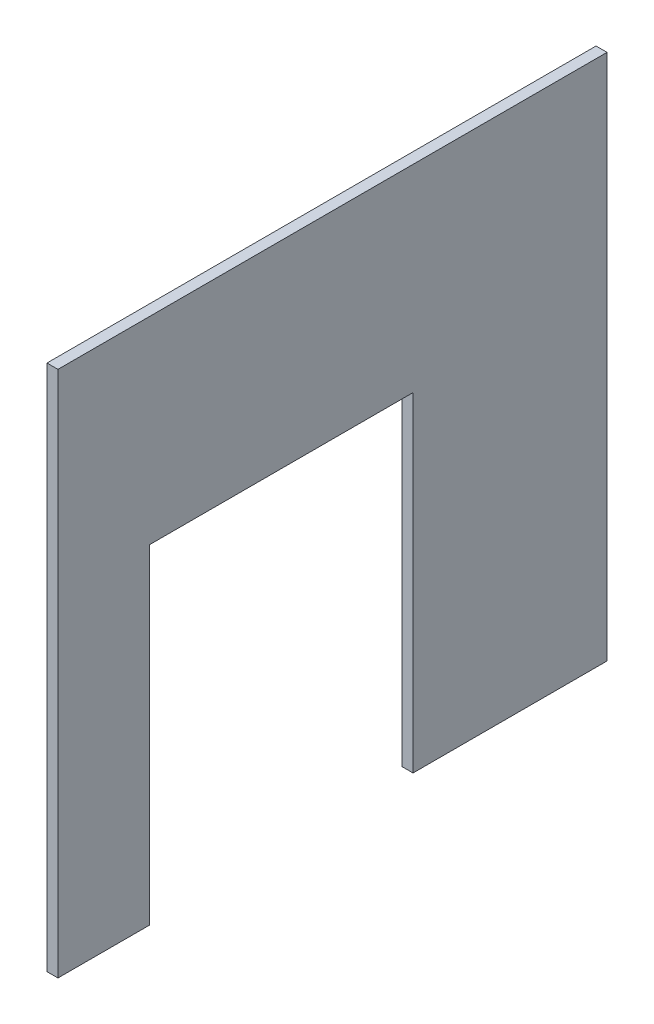
ISO-10303-21;
HEADER;
FILE_DESCRIPTION(('STEP AP214'),'2;1');
FILE_NAME('part.step','',(''),(''),'','','');
FILE_SCHEMA(('AUTOMOTIVE_DESIGN { 1 0 10303 214 1 1 1 1 }'));
ENDSEC;
DATA;
#1=APPLICATION_CONTEXT('core data for automotive mechanical design processes');
#2=APPLICATION_PROTOCOL_DEFINITION('international standard','automotive_design',2000,#1);
#3=PRODUCT_CONTEXT('',#1,'mechanical');
#4=PRODUCT('Part','Part','',(#3));
#5=PRODUCT_RELATED_PRODUCT_CATEGORY('part','',(#4));
#6=PRODUCT_DEFINITION_FORMATION('','',#4);
#7=PRODUCT_DEFINITION_CONTEXT('part definition',#1,'design');
#8=PRODUCT_DEFINITION('design','',#6,#7);
#9=PRODUCT_DEFINITION_SHAPE('','',#8);
#10=(LENGTH_UNIT() NAMED_UNIT(*) SI_UNIT(.MILLI.,.METRE.));
#11=(NAMED_UNIT(*) PLANE_ANGLE_UNIT() SI_UNIT($,.RADIAN.));
#12=(NAMED_UNIT(*) SI_UNIT($,.STERADIAN.) SOLID_ANGLE_UNIT());
#13=UNCERTAINTY_MEASURE_WITH_UNIT(LENGTH_MEASURE(1.E-05),#10,'distance_accuracy_value','');
#14=(GEOMETRIC_REPRESENTATION_CONTEXT(3) GLOBAL_UNCERTAINTY_ASSIGNED_CONTEXT((#13)) GLOBAL_UNIT_ASSIGNED_CONTEXT((#10,
#11,#12)) REPRESENTATION_CONTEXT('',''));
#15=CARTESIAN_POINT('',(0.,0.,0.));
#16=DIRECTION('',(0.,0.,1.));
#17=DIRECTION('',(1.,0.,0.));
#18=AXIS2_PLACEMENT_3D('',#15,#16,#17);
#19=CARTESIAN_POINT('',(6.,0.,0.));
#20=DIRECTION('',(0.,0.,-1.));
#21=DIRECTION('',(-1.,0.,0.));
#22=AXIS2_PLACEMENT_3D('',#19,#20,#21);
#23=PLANE('',#22);
#24=DIRECTION('',(0.,-1.,0.));
#25=VECTOR('',#24,1.);
#26=CARTESIAN_POINT('',(0.,0.,0.));
#27=LINE('',#26,#25);
#28=CARTESIAN_POINT('',(0.,288.,0.));
#29=VERTEX_POINT('',#28);
#30=CARTESIAN_POINT('',(0.,0.,0.));
#31=VERTEX_POINT('',#30);
#32=EDGE_CURVE('E140',#29,#31,#27,.T.);
#33=ORIENTED_EDGE('',*,*,#32,.T.);
#34=DIRECTION('',(-1.,0.,0.));
#35=VECTOR('',#34,1.);
#36=CARTESIAN_POINT('',(6.,0.,0.));
#37=LINE('',#36,#35);
#38=CARTESIAN_POINT('',(6.,0.,0.));
#39=VERTEX_POINT('',#38);
#40=EDGE_CURVE('E11',#39,#31,#37,.T.);
#41=ORIENTED_EDGE('',*,*,#40,.F.);
#42=DIRECTION('',(0.,-1.,0.));
#43=VECTOR('',#42,1.);
#44=CARTESIAN_POINT('',(6.,0.,0.));
#45=LINE('',#44,#43);
#46=CARTESIAN_POINT('',(6.,288.,0.));
#47=VERTEX_POINT('',#46);
#48=EDGE_CURVE('E162',#47,#39,#45,.T.);
#49=ORIENTED_EDGE('',*,*,#48,.F.);
#50=DIRECTION('',(-1.,0.,0.));
#51=VECTOR('',#50,1.);
#52=CARTESIAN_POINT('',(6.,288.,0.));
#53=LINE('',#52,#51);
#54=EDGE_CURVE('E136',#47,#29,#53,.T.);
#55=ORIENTED_EDGE('',*,*,#54,.T.);
#56=EDGE_LOOP('',(#33,#41,#49,#55));
#57=FACE_BOUND('',#56,.T.);
#58=ADVANCED_FACE('F39',(#57),#23,.F.);
#59=CARTESIAN_POINT('',(6.,0.,0.));
#60=DIRECTION('',(0.,1.,0.));
#61=DIRECTION('',(0.,0.,1.));
#62=AXIS2_PLACEMENT_3D('',#59,#60,#61);
#63=PLANE('',#62);
#64=DIRECTION('',(0.,0.,-1.));
#65=VECTOR('',#64,1.);
#66=CARTESIAN_POINT('',(0.,0.,0.));
#67=LINE('',#66,#65);
#68=CARTESIAN_POINT('',(0.,0.,-50.));
#69=VERTEX_POINT('',#68);
#70=EDGE_CURVE('E144',#31,#69,#67,.T.);
#71=ORIENTED_EDGE('',*,*,#70,.T.);
#72=DIRECTION('',(-1.,0.,0.));
#73=VECTOR('',#72,1.);
#74=CARTESIAN_POINT('',(6.,0.,-50.));
#75=LINE('',#74,#73);
#76=CARTESIAN_POINT('',(6.,0.,-50.));
#77=VERTEX_POINT('',#76);
#78=EDGE_CURVE('E48',#77,#69,#75,.T.);
#79=ORIENTED_EDGE('',*,*,#78,.F.);
#80=DIRECTION('',(0.,0.,-1.));
#81=VECTOR('',#80,1.);
#82=CARTESIAN_POINT('',(6.,0.,0.));
#83=LINE('',#82,#81);
#84=EDGE_CURVE('E99',#39,#77,#83,.T.);
#85=ORIENTED_EDGE('',*,*,#84,.F.);
#86=ORIENTED_EDGE('',*,*,#40,.T.);
#87=EDGE_LOOP('',(#71,#79,#85,#86));
#88=FACE_BOUND('',#87,.T.);
#89=ADVANCED_FACE('F208',(#88),#63,.F.);
#90=CARTESIAN_POINT('',(6.,0.,-50.));
#91=DIRECTION('',(0.,0.,1.));
#92=DIRECTION('',(1.,0.,0.));
#93=AXIS2_PLACEMENT_3D('',#90,#91,#92);
#94=PLANE('',#93);
#95=DIRECTION('',(0.,1.,0.));
#96=VECTOR('',#95,1.);
#97=CARTESIAN_POINT('',(0.,0.,-50.));
#98=LINE('',#97,#96);
#99=CARTESIAN_POINT('',(0.,180.,-50.));
#100=VERTEX_POINT('',#99);
#101=EDGE_CURVE('E147',#69,#100,#98,.T.);
#102=ORIENTED_EDGE('',*,*,#101,.T.);
#103=DIRECTION('',(-1.,0.,0.));
#104=VECTOR('',#103,1.);
#105=CARTESIAN_POINT('',(6.,180.,-50.));
#106=LINE('',#105,#104);
#107=CARTESIAN_POINT('',(6.,180.,-50.));
#108=VERTEX_POINT('',#107);
#109=EDGE_CURVE('E173',#108,#100,#106,.T.);
#110=ORIENTED_EDGE('',*,*,#109,.F.);
#111=DIRECTION('',(0.,1.,0.));
#112=VECTOR('',#111,1.);
#113=CARTESIAN_POINT('',(6.,0.,-50.));
#114=LINE('',#113,#112);
#115=EDGE_CURVE('E183',#77,#108,#114,.T.);
#116=ORIENTED_EDGE('',*,*,#115,.F.);
#117=ORIENTED_EDGE('',*,*,#78,.T.);
#118=EDGE_LOOP('',(#102,#110,#116,#117));
#119=FACE_BOUND('',#118,.T.);
#120=ADVANCED_FACE('F181',(#119),#94,.F.);
#121=CARTESIAN_POINT('',(6.,180.,-50.));
#122=DIRECTION('',(0.,1.,0.));
#123=DIRECTION('',(0.,0.,1.));
#124=AXIS2_PLACEMENT_3D('',#121,#122,#123);
#125=PLANE('',#124);
#126=DIRECTION('',(0.,0.,-1.));
#127=VECTOR('',#126,1.);
#128=CARTESIAN_POINT('',(0.,180.,-50.));
#129=LINE('',#128,#127);
#130=CARTESIAN_POINT('',(0.,180.,-194.));
#131=VERTEX_POINT('',#130);
#132=EDGE_CURVE('E150',#100,#131,#129,.T.);
#133=ORIENTED_EDGE('',*,*,#132,.T.);
#134=DIRECTION('',(-1.,0.,0.));
#135=VECTOR('',#134,1.);
#136=CARTESIAN_POINT('',(6.,180.,-194.));
#137=LINE('',#136,#135);
#138=CARTESIAN_POINT('',(6.,180.,-194.));
#139=VERTEX_POINT('',#138);
#140=EDGE_CURVE('E169',#139,#131,#137,.T.);
#141=ORIENTED_EDGE('',*,*,#140,.F.);
#142=DIRECTION('',(0.,0.,-1.));
#143=VECTOR('',#142,1.);
#144=CARTESIAN_POINT('',(6.,180.,-50.));
#145=LINE('',#144,#143);
#146=EDGE_CURVE('E196',#108,#139,#145,.T.);
#147=ORIENTED_EDGE('',*,*,#146,.F.);
#148=ORIENTED_EDGE('',*,*,#109,.T.);
#149=EDGE_LOOP('',(#133,#141,#147,#148));
#150=FACE_BOUND('',#149,.T.);
#151=ADVANCED_FACE('F191',(#150),#125,.F.);
#152=CARTESIAN_POINT('',(6.,180.,-194.));
#153=DIRECTION('',(0.,0.,-1.));
#154=DIRECTION('',(-1.,0.,0.));
#155=AXIS2_PLACEMENT_3D('',#152,#153,#154);
#156=PLANE('',#155);
#157=DIRECTION('',(0.,-1.,0.));
#158=VECTOR('',#157,1.);
#159=CARTESIAN_POINT('',(0.,180.,-194.));
#160=LINE('',#159,#158);
#161=CARTESIAN_POINT('',(0.,0.,-194.));
#162=VERTEX_POINT('',#161);
#163=EDGE_CURVE('E153',#131,#162,#160,.T.);
#164=ORIENTED_EDGE('',*,*,#163,.T.);
#165=DIRECTION('',(-1.,0.,0.));
#166=VECTOR('',#165,1.);
#167=CARTESIAN_POINT('',(6.,0.,-194.));
#168=LINE('',#167,#166);
#169=CARTESIAN_POINT('',(6.,0.,-194.));
#170=VERTEX_POINT('',#169);
#171=EDGE_CURVE('E129',#170,#162,#168,.T.);
#172=ORIENTED_EDGE('',*,*,#171,.F.);
#173=DIRECTION('',(0.,-1.,0.));
#174=VECTOR('',#173,1.);
#175=CARTESIAN_POINT('',(6.,180.,-194.));
#176=LINE('',#175,#174);
#177=EDGE_CURVE('E118',#139,#170,#176,.T.);
#178=ORIENTED_EDGE('',*,*,#177,.F.);
#179=ORIENTED_EDGE('',*,*,#140,.T.);
#180=EDGE_LOOP('',(#164,#172,#178,#179));
#181=FACE_BOUND('',#180,.T.);
#182=ADVANCED_FACE('F194',(#181),#156,.F.);
#183=CARTESIAN_POINT('',(6.,0.,-194.));
#184=DIRECTION('',(0.,1.,0.));
#185=DIRECTION('',(0.,0.,1.));
#186=AXIS2_PLACEMENT_3D('',#183,#184,#185);
#187=PLANE('',#186);
#188=DIRECTION('',(0.,0.,-1.));
#189=VECTOR('',#188,1.);
#190=CARTESIAN_POINT('',(0.,0.,-194.));
#191=LINE('',#190,#189);
#192=CARTESIAN_POINT('',(0.,0.,-300.));
#193=VERTEX_POINT('',#192);
#194=EDGE_CURVE('E127',#162,#193,#191,.T.);
#195=ORIENTED_EDGE('',*,*,#194,.T.);
#196=DIRECTION('',(-1.,0.,0.));
#197=VECTOR('',#196,1.);
#198=CARTESIAN_POINT('',(6.,0.,-300.));
#199=LINE('',#198,#197);
#200=CARTESIAN_POINT('',(6.,0.,-300.));
#201=VERTEX_POINT('',#200);
#202=EDGE_CURVE('E124',#201,#193,#199,.T.);
#203=ORIENTED_EDGE('',*,*,#202,.F.);
#204=DIRECTION('',(0.,0.,-1.));
#205=VECTOR('',#204,1.);
#206=CARTESIAN_POINT('',(6.,0.,-194.));
#207=LINE('',#206,#205);
#208=EDGE_CURVE('E112',#170,#201,#207,.T.);
#209=ORIENTED_EDGE('',*,*,#208,.F.);
#210=ORIENTED_EDGE('',*,*,#171,.T.);
#211=EDGE_LOOP('',(#195,#203,#209,#210));
#212=FACE_BOUND('',#211,.T.);
#213=ADVANCED_FACE('F125',(#212),#187,.F.);
#214=CARTESIAN_POINT('',(6.,0.,-300.));
#215=DIRECTION('',(0.,0.,1.));
#216=DIRECTION('',(1.,0.,0.));
#217=AXIS2_PLACEMENT_3D('',#214,#215,#216);
#218=PLANE('',#217);
#219=DIRECTION('',(0.,1.,0.));
#220=VECTOR('',#219,1.);
#221=CARTESIAN_POINT('',(0.,0.,-300.));
#222=LINE('',#221,#220);
#223=CARTESIAN_POINT('',(0.,288.,-300.));
#224=VERTEX_POINT('',#223);
#225=EDGE_CURVE('E85',#193,#224,#222,.T.);
#226=ORIENTED_EDGE('',*,*,#225,.T.);
#227=DIRECTION('',(-1.,0.,0.));
#228=VECTOR('',#227,1.);
#229=CARTESIAN_POINT('',(6.,288.,-300.));
#230=LINE('',#229,#228);
#231=CARTESIAN_POINT('',(6.,288.,-300.));
#232=VERTEX_POINT('',#231);
#233=EDGE_CURVE('E130',#232,#224,#230,.T.);
#234=ORIENTED_EDGE('',*,*,#233,.F.);
#235=DIRECTION('',(0.,1.,0.));
#236=VECTOR('',#235,1.);
#237=CARTESIAN_POINT('',(6.,0.,-300.));
#238=LINE('',#237,#236);
#239=EDGE_CURVE('E116',#201,#232,#238,.T.);
#240=ORIENTED_EDGE('',*,*,#239,.F.);
#241=ORIENTED_EDGE('',*,*,#202,.T.);
#242=EDGE_LOOP('',(#226,#234,#240,#241));
#243=FACE_BOUND('',#242,.T.);
#244=ADVANCED_FACE('F132',(#243),#218,.F.);
#245=CARTESIAN_POINT('',(6.,288.,0.));
#246=DIRECTION('',(0.,-1.,0.));
#247=DIRECTION('',(0.,0.,-1.));
#248=AXIS2_PLACEMENT_3D('',#245,#246,#247);
#249=PLANE('',#248);
#250=DIRECTION('',(0.,0.,1.));
#251=VECTOR('',#250,1.);
#252=CARTESIAN_POINT('',(0.,288.,0.));
#253=LINE('',#252,#251);
#254=EDGE_CURVE('E91',#224,#29,#253,.T.);
#255=ORIENTED_EDGE('',*,*,#254,.T.);
#256=ORIENTED_EDGE('',*,*,#54,.F.);
#257=DIRECTION('',(0.,0.,1.));
#258=VECTOR('',#257,1.);
#259=CARTESIAN_POINT('',(6.,288.,0.));
#260=LINE('',#259,#258);
#261=EDGE_CURVE('E56',#232,#47,#260,.T.);
#262=ORIENTED_EDGE('',*,*,#261,.F.);
#263=ORIENTED_EDGE('',*,*,#233,.T.);
#264=EDGE_LOOP('',(#255,#256,#262,#263));
#265=FACE_BOUND('',#264,.T.);
#266=ADVANCED_FACE('F224',(#265),#249,.F.);
#267=CARTESIAN_POINT('',(6.,0.,0.));
#268=DIRECTION('',(-1.,0.,0.));
#269=DIRECTION('',(0.,0.,1.));
#270=AXIS2_PLACEMENT_3D('',#267,#268,#269);
#271=PLANE('',#270);
#272=ORIENTED_EDGE('',*,*,#48,.T.);
#273=ORIENTED_EDGE('',*,*,#84,.T.);
#274=ORIENTED_EDGE('',*,*,#115,.T.);
#275=ORIENTED_EDGE('',*,*,#146,.T.);
#276=ORIENTED_EDGE('',*,*,#177,.T.);
#277=ORIENTED_EDGE('',*,*,#208,.T.);
#278=ORIENTED_EDGE('',*,*,#239,.T.);
#279=ORIENTED_EDGE('',*,*,#261,.T.);
#280=EDGE_LOOP('',(#272,#273,#274,#275,#276,#277,#278,#279));
#281=FACE_BOUND('',#280,.T.);
#282=ADVANCED_FACE('F114',(#281),#271,.F.);
#283=CARTESIAN_POINT('',(0.,0.,0.));
#284=DIRECTION('',(-1.,0.,0.));
#285=DIRECTION('',(0.,0.,1.));
#286=AXIS2_PLACEMENT_3D('',#283,#284,#285);
#287=PLANE('',#286);
#288=ORIENTED_EDGE('',*,*,#32,.F.);
#289=ORIENTED_EDGE('',*,*,#254,.F.);
#290=ORIENTED_EDGE('',*,*,#225,.F.);
#291=ORIENTED_EDGE('',*,*,#194,.F.);
#292=ORIENTED_EDGE('',*,*,#163,.F.);
#293=ORIENTED_EDGE('',*,*,#132,.F.);
#294=ORIENTED_EDGE('',*,*,#101,.F.);
#295=ORIENTED_EDGE('',*,*,#70,.F.);
#296=EDGE_LOOP('',(#288,#289,#290,#291,#292,#293,#294,#295));
#297=FACE_BOUND('',#296,.T.);
#298=ADVANCED_FACE('F187',(#297),#287,.T.);
#299=CLOSED_SHELL('',(#58,#89,#120,#151,#182,#213,#244,#266,#282,#298));
#300=MANIFOLD_SOLID_BREP('B2',#299);
#301=ADVANCED_BREP_SHAPE_REPRESENTATION('',(#18,#300),#14);
#302=SHAPE_DEFINITION_REPRESENTATION(#9,#301);
ENDSEC;
END-ISO-10303-21;
